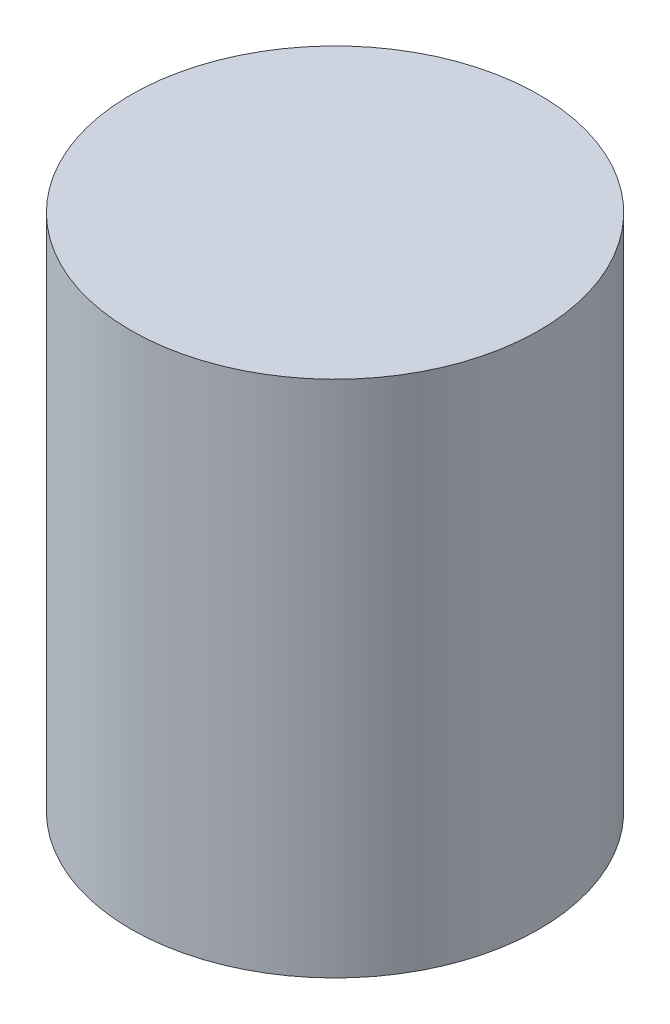
ISO-10303-21;
HEADER;
FILE_DESCRIPTION(('STEP AP214'),'2;1');
FILE_NAME('part.step','',(''),(''),'','','');
FILE_SCHEMA(('AUTOMOTIVE_DESIGN { 1 0 10303 214 1 1 1 1 }'));
ENDSEC;
DATA;
#1=APPLICATION_CONTEXT('core data for automotive mechanical design processes');
#2=APPLICATION_PROTOCOL_DEFINITION('international standard','automotive_design',2000,#1);
#3=PRODUCT_CONTEXT('',#1,'mechanical');
#4=PRODUCT('Part','Part','',(#3));
#5=PRODUCT_RELATED_PRODUCT_CATEGORY('part','',(#4));
#6=PRODUCT_DEFINITION_FORMATION('','',#4);
#7=PRODUCT_DEFINITION_CONTEXT('part definition',#1,'design');
#8=PRODUCT_DEFINITION('design','',#6,#7);
#9=PRODUCT_DEFINITION_SHAPE('','',#8);
#10=(LENGTH_UNIT() NAMED_UNIT(*) SI_UNIT(.MILLI.,.METRE.));
#11=(NAMED_UNIT(*) PLANE_ANGLE_UNIT() SI_UNIT($,.RADIAN.));
#12=(NAMED_UNIT(*) SI_UNIT($,.STERADIAN.) SOLID_ANGLE_UNIT());
#13=UNCERTAINTY_MEASURE_WITH_UNIT(LENGTH_MEASURE(1.E-05),#10,'distance_accuracy_value','');
#14=(GEOMETRIC_REPRESENTATION_CONTEXT(3) GLOBAL_UNCERTAINTY_ASSIGNED_CONTEXT((#13)) GLOBAL_UNIT_ASSIGNED_CONTEXT((#10,
#11,#12)) REPRESENTATION_CONTEXT('',''));
#15=CARTESIAN_POINT('',(0.,0.,0.));
#16=DIRECTION('',(0.,0.,1.));
#17=DIRECTION('',(1.,0.,0.));
#18=AXIS2_PLACEMENT_3D('',#15,#16,#17);
#19=CARTESIAN_POINT('',(0.,27.94,0.));
#20=DIRECTION('',(0.,1.,0.));
#21=DIRECTION('',(0.,0.,1.));
#22=AXIS2_PLACEMENT_3D('',#19,#20,#21);
#23=PLANE('',#22);
#24=CARTESIAN_POINT('',(0.,27.94,0.));
#25=DIRECTION('',(0.,1.,0.));
#26=DIRECTION('',(0.,0.,1.));
#27=AXIS2_PLACEMENT_3D('',#24,#25,#26);
#28=CIRCLE('',#27,11.);
#29=CARTESIAN_POINT('',(0.,27.94,11.));
#30=VERTEX_POINT('',#29);
#31=EDGE_CURVE('E10',#30,#30,#28,.T.);
#32=ORIENTED_EDGE('',*,*,#31,.T.);
#33=EDGE_LOOP('',(#32));
#34=FACE_BOUND('',#33,.T.);
#35=ADVANCED_FACE('F32',(#34),#23,.T.);
#36=CARTESIAN_POINT('',(0.,0.,0.));
#37=DIRECTION('',(0.,1.,0.));
#38=DIRECTION('',(0.,0.,1.));
#39=AXIS2_PLACEMENT_3D('',#36,#37,#38);
#40=PLANE('',#39);
#41=CARTESIAN_POINT('',(0.,0.,0.));
#42=DIRECTION('',(0.,1.,0.));
#43=DIRECTION('',(0.,0.,1.));
#44=AXIS2_PLACEMENT_3D('',#41,#42,#43);
#45=CIRCLE('',#44,11.);
#46=CARTESIAN_POINT('',(0.,0.,11.));
#47=VERTEX_POINT('',#46);
#48=EDGE_CURVE('E36',#47,#47,#45,.T.);
#49=ORIENTED_EDGE('',*,*,#48,.F.);
#50=EDGE_LOOP('',(#49));
#51=FACE_BOUND('',#50,.T.);
#52=ADVANCED_FACE('F47',(#51),#40,.F.);
#53=CARTESIAN_POINT('',(0.,27.94,0.));
#54=DIRECTION('',(0.,-1.,0.));
#55=DIRECTION('',(0.,0.,-1.));
#56=AXIS2_PLACEMENT_3D('',#53,#54,#55);
#57=CYLINDRICAL_SURFACE('',#56,11.);
#58=ORIENTED_EDGE('',*,*,#48,.T.);
#59=EDGE_LOOP('',(#58));
#60=FACE_BOUND('',#59,.T.);
#61=ORIENTED_EDGE('',*,*,#31,.F.);
#62=EDGE_LOOP('',(#61));
#63=FACE_BOUND('',#62,.T.);
#64=ADVANCED_FACE('F34',(#60,#63),#57,.T.);
#65=CLOSED_SHELL('',(#35,#52,#64));
#66=MANIFOLD_SOLID_BREP('B2',#65);
#67=ADVANCED_BREP_SHAPE_REPRESENTATION('',(#18,#66),#14);
#68=SHAPE_DEFINITION_REPRESENTATION(#9,#67);
ENDSEC;
END-ISO-10303-21;
